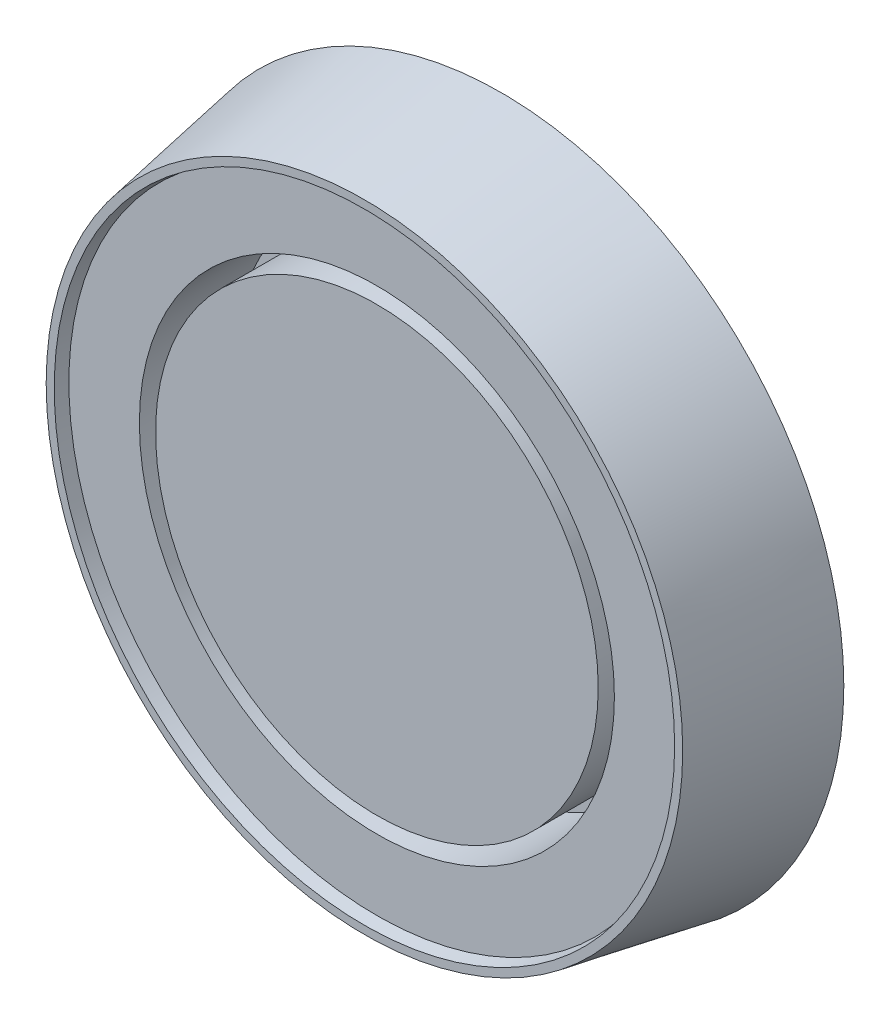
ISO-10303-21;
HEADER;
FILE_DESCRIPTION(('STEP AP214'),'2;1');
FILE_NAME('part.step','',(''),(''),'','','');
FILE_SCHEMA(('AUTOMOTIVE_DESIGN { 1 0 10303 214 1 1 1 1 }'));
ENDSEC;
DATA;
#1=APPLICATION_CONTEXT('core data for automotive mechanical design processes');
#2=APPLICATION_PROTOCOL_DEFINITION('international standard','automotive_design',2000,#1);
#3=PRODUCT_CONTEXT('',#1,'mechanical');
#4=PRODUCT('Part','Part','',(#3));
#5=PRODUCT_RELATED_PRODUCT_CATEGORY('part','',(#4));
#6=PRODUCT_DEFINITION_FORMATION('','',#4);
#7=PRODUCT_DEFINITION_CONTEXT('part definition',#1,'design');
#8=PRODUCT_DEFINITION('design','',#6,#7);
#9=PRODUCT_DEFINITION_SHAPE('','',#8);
#10=(LENGTH_UNIT() NAMED_UNIT(*) SI_UNIT(.MILLI.,.METRE.));
#11=(NAMED_UNIT(*) PLANE_ANGLE_UNIT() SI_UNIT($,.RADIAN.));
#12=(NAMED_UNIT(*) SI_UNIT($,.STERADIAN.) SOLID_ANGLE_UNIT());
#13=UNCERTAINTY_MEASURE_WITH_UNIT(LENGTH_MEASURE(1.E-05),#10,'distance_accuracy_value','');
#14=(GEOMETRIC_REPRESENTATION_CONTEXT(3) GLOBAL_UNCERTAINTY_ASSIGNED_CONTEXT((#13)) GLOBAL_UNIT_ASSIGNED_CONTEXT((#10,
#11,#12)) REPRESENTATION_CONTEXT('',''));
#15=CARTESIAN_POINT('',(0.,0.,0.));
#16=DIRECTION('',(0.,0.,1.));
#17=DIRECTION('',(1.,0.,0.));
#18=AXIS2_PLACEMENT_3D('',#15,#16,#17);
#19=CARTESIAN_POINT('',(0.,0.,20.));
#20=DIRECTION('',(0.,0.,1.));
#21=DIRECTION('',(1.,0.,0.));
#22=AXIS2_PLACEMENT_3D('',#19,#20,#21);
#23=PLANE('',#22);
#24=CARTESIAN_POINT('',(0.,0.,20.));
#25=DIRECTION('',(0.,0.,1.));
#26=DIRECTION('',(1.,0.,0.));
#27=AXIS2_PLACEMENT_3D('',#24,#25,#26);
#28=CIRCLE('',#27,38.15);
#29=CARTESIAN_POINT('',(38.15,0.,20.));
#30=VERTEX_POINT('',#29);
#31=EDGE_CURVE('E55',#30,#30,#28,.T.);
#32=ORIENTED_EDGE('',*,*,#31,.F.);
#33=EDGE_LOOP('',(#32));
#34=FACE_BOUND('',#33,.T.);
#35=CARTESIAN_POINT('',(0.,0.,20.));
#36=DIRECTION('',(0.,0.,1.));
#37=DIRECTION('',(1.,0.,0.));
#38=AXIS2_PLACEMENT_3D('',#35,#36,#37);
#39=CIRCLE('',#38,49.4734603858307);
#40=CARTESIAN_POINT('',(49.4734603858307,0.,20.));
#41=VERTEX_POINT('',#40);
#42=EDGE_CURVE('E11',#41,#41,#39,.F.);
#43=ORIENTED_EDGE('',*,*,#42,.F.);
#44=EDGE_LOOP('',(#43));
#45=FACE_BOUND('',#44,.T.);
#46=ADVANCED_FACE('F37',(#34,#45),#23,.T.);
#47=CARTESIAN_POINT('',(0.,0.,-107.904494809067));
#48=DIRECTION('',(0.,0.,1.));
#49=DIRECTION('',(1.,0.,0.));
#50=AXIS2_PLACEMENT_3D('',#47,#48,#49);
#51=CYLINDRICAL_SURFACE('',#50,38.15);
#52=CARTESIAN_POINT('',(0.,0.,5.));
#53=DIRECTION('',(0.,0.,1.));
#54=DIRECTION('',(1.,0.,0.));
#55=AXIS2_PLACEMENT_3D('',#52,#53,#54);
#56=CIRCLE('',#55,38.15);
#57=CARTESIAN_POINT('',(38.15,0.,5.));
#58=VERTEX_POINT('',#57);
#59=EDGE_CURVE('E52',#58,#58,#56,.F.);
#60=ORIENTED_EDGE('',*,*,#59,.T.);
#61=EDGE_LOOP('',(#60));
#62=FACE_BOUND('',#61,.T.);
#63=ORIENTED_EDGE('',*,*,#31,.T.);
#64=EDGE_LOOP('',(#63));
#65=FACE_BOUND('',#64,.T.);
#66=ADVANCED_FACE('F81',(#62,#65),#51,.F.);
#67=CARTESIAN_POINT('',(0.,0.,-107.904494809067));
#68=DIRECTION('',(0.,0.,1.));
#69=DIRECTION('',(1.,0.,0.));
#70=AXIS2_PLACEMENT_3D('',#67,#68,#69);
#71=CYLINDRICAL_SURFACE('',#70,35.55);
#72=CARTESIAN_POINT('',(0.,0.,5.));
#73=DIRECTION('',(0.,0.,1.));
#74=DIRECTION('',(1.,0.,0.));
#75=AXIS2_PLACEMENT_3D('',#72,#73,#74);
#76=CIRCLE('',#75,35.55);
#77=CARTESIAN_POINT('',(35.55,0.,5.));
#78=VERTEX_POINT('',#77);
#79=EDGE_CURVE('E48',#78,#78,#76,.F.);
#80=ORIENTED_EDGE('',*,*,#79,.F.);
#81=EDGE_LOOP('',(#80));
#82=FACE_BOUND('',#81,.T.);
#83=CARTESIAN_POINT('',(0.,0.,20.));
#84=DIRECTION('',(0.,0.,1.));
#85=DIRECTION('',(1.,0.,0.));
#86=AXIS2_PLACEMENT_3D('',#83,#84,#85);
#87=CIRCLE('',#86,35.55);
#88=CARTESIAN_POINT('',(35.55,0.,20.));
#89=VERTEX_POINT('',#88);
#90=EDGE_CURVE('E58',#89,#89,#87,.T.);
#91=ORIENTED_EDGE('',*,*,#90,.F.);
#92=EDGE_LOOP('',(#91));
#93=FACE_BOUND('',#92,.T.);
#94=ADVANCED_FACE('F88',(#82,#93),#71,.T.);
#95=CARTESIAN_POINT('',(0.,0.,5.));
#96=DIRECTION('',(0.,0.,1.));
#97=DIRECTION('',(1.,0.,0.));
#98=AXIS2_PLACEMENT_3D('',#95,#96,#97);
#99=PLANE('',#98);
#100=ORIENTED_EDGE('',*,*,#59,.F.);
#101=EDGE_LOOP('',(#100));
#102=FACE_BOUND('',#101,.T.);
#103=ORIENTED_EDGE('',*,*,#79,.T.);
#104=EDGE_LOOP('',(#103));
#105=FACE_BOUND('',#104,.T.);
#106=ADVANCED_FACE('F94',(#102,#105),#99,.T.);
#107=ORIENTED_EDGE('',*,*,#90,.T.);
#108=EDGE_LOOP('',(#107));
#109=FACE_BOUND('',#108,.T.);
#110=ADVANCED_FACE('F84',(#109),#23,.T.);
#111=CARTESIAN_POINT('',(0.,0.,22.));
#112=DIRECTION('',(0.,0.,1.));
#113=DIRECTION('',(1.,0.,0.));
#114=AXIS2_PLACEMENT_3D('',#111,#112,#113);
#115=PLANE('',#114);
#116=CARTESIAN_POINT('',(0.,0.,22.));
#117=DIRECTION('',(0.,0.,1.));
#118=DIRECTION('',(1.,0.,0.));
#119=AXIS2_PLACEMENT_3D('',#116,#117,#118);
#120=CIRCLE('',#119,51.1208064244138);
#121=CARTESIAN_POINT('',(51.1208064244138,0.,22.));
#122=VERTEX_POINT('',#121);
#123=EDGE_CURVE('E61',#122,#122,#120,.T.);
#124=ORIENTED_EDGE('',*,*,#123,.T.);
#125=EDGE_LOOP('',(#124));
#126=FACE_BOUND('',#125,.T.);
#127=CARTESIAN_POINT('',(0.,0.,22.));
#128=DIRECTION('',(0.,0.,1.));
#129=DIRECTION('',(1.,0.,0.));
#130=AXIS2_PLACEMENT_3D('',#127,#128,#129);
#131=CIRCLE('',#130,49.8261143472476);
#132=CARTESIAN_POINT('',(49.8261143472476,0.,22.));
#133=VERTEX_POINT('',#132);
#134=EDGE_CURVE('E64',#133,#133,#131,.T.);
#135=ORIENTED_EDGE('',*,*,#134,.F.);
#136=EDGE_LOOP('',(#135));
#137=FACE_BOUND('',#136,.T.);
#138=ADVANCED_FACE('F70',(#126,#137),#115,.T.);
#139=CARTESIAN_POINT('',(0.,0.,20.));
#140=DIRECTION('',(0.,0.,1.));
#141=DIRECTION('',(1.,0.,0.));
#142=AXIS2_PLACEMENT_3D('',#139,#140,#141);
#143=CONICAL_SURFACE('',#142,49.4734603858307,0.174532925199433);
#144=ORIENTED_EDGE('',*,*,#134,.T.);
#145=EDGE_LOOP('',(#144));
#146=FACE_BOUND('',#145,.T.);
#147=ORIENTED_EDGE('',*,*,#42,.T.);
#148=EDGE_LOOP('',(#147));
#149=FACE_BOUND('',#148,.T.);
#150=ADVANCED_FACE('F78',(#146,#149),#143,.F.);
#151=CARTESIAN_POINT('',(0.,0.,0.));
#152=DIRECTION('',(0.,0.,1.));
#153=DIRECTION('',(1.,0.,0.));
#154=AXIS2_PLACEMENT_3D('',#151,#152,#153);
#155=PLANE('',#154);
#156=CARTESIAN_POINT('',(0.,0.,0.));
#157=DIRECTION('',(0.,0.,1.));
#158=DIRECTION('',(1.,0.,0.));
#159=AXIS2_PLACEMENT_3D('',#156,#157,#158);
#160=CIRCLE('',#159,55.);
#161=CARTESIAN_POINT('',(55.,0.,0.));
#162=VERTEX_POINT('',#161);
#163=EDGE_CURVE('E44',#162,#162,#160,.T.);
#164=ORIENTED_EDGE('',*,*,#163,.F.);
#165=EDGE_LOOP('',(#164));
#166=FACE_BOUND('',#165,.T.);
#167=ADVANCED_FACE('F74',(#166),#155,.F.);
#168=CARTESIAN_POINT('',(0.,0.,0.));
#169=DIRECTION('',(0.,0.,-1.));
#170=DIRECTION('',(1.,0.,0.));
#171=AXIS2_PLACEMENT_3D('',#168,#169,#170);
#172=CONICAL_SURFACE('',#171,55.,0.174532925199433);
#173=ORIENTED_EDGE('',*,*,#163,.T.);
#174=EDGE_LOOP('',(#173));
#175=FACE_BOUND('',#174,.T.);
#176=ORIENTED_EDGE('',*,*,#123,.F.);
#177=EDGE_LOOP('',(#176));
#178=FACE_BOUND('',#177,.T.);
#179=ADVANCED_FACE('F39',(#175,#178),#172,.T.);
#180=CLOSED_SHELL('',(#46,#66,#94,#106,#110,#138,#150,#167,#179));
#181=MANIFOLD_SOLID_BREP('B2',#180);
#182=ADVANCED_BREP_SHAPE_REPRESENTATION('',(#18,#181),#14);
#183=SHAPE_DEFINITION_REPRESENTATION(#9,#182);
ENDSEC;
END-ISO-10303-21;
